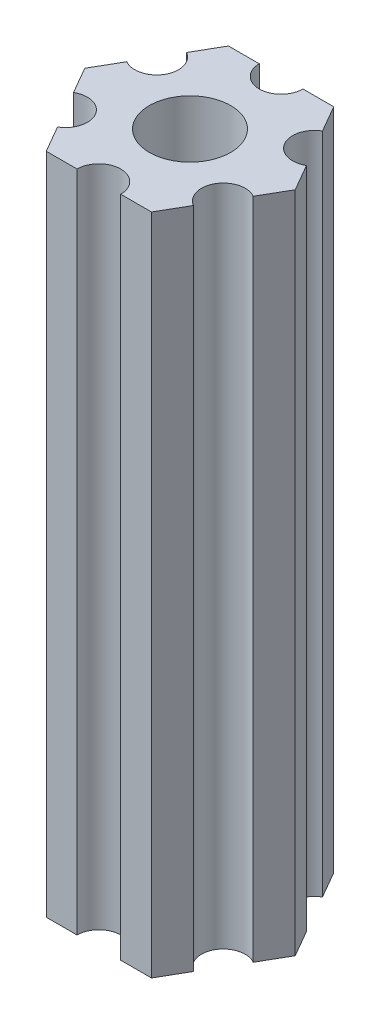
ISO-10303-21;
HEADER;
FILE_DESCRIPTION(('STEP AP214'),'2;1');
FILE_NAME('part.step','',(''),(''),'','','');
FILE_SCHEMA(('AUTOMOTIVE_DESIGN { 1 0 10303 214 1 1 1 1 }'));
ENDSEC;
DATA;
#1=APPLICATION_CONTEXT('core data for automotive mechanical design processes');
#2=APPLICATION_PROTOCOL_DEFINITION('international standard','automotive_design',2000,#1);
#3=PRODUCT_CONTEXT('',#1,'mechanical');
#4=PRODUCT('Part','Part','',(#3));
#5=PRODUCT_RELATED_PRODUCT_CATEGORY('part','',(#4));
#6=PRODUCT_DEFINITION_FORMATION('','',#4);
#7=PRODUCT_DEFINITION_CONTEXT('part definition',#1,'design');
#8=PRODUCT_DEFINITION('design','',#6,#7);
#9=PRODUCT_DEFINITION_SHAPE('','',#8);
#10=(LENGTH_UNIT() NAMED_UNIT(*) SI_UNIT(.MILLI.,.METRE.));
#11=(NAMED_UNIT(*) PLANE_ANGLE_UNIT() SI_UNIT($,.RADIAN.));
#12=(NAMED_UNIT(*) SI_UNIT($,.STERADIAN.) SOLID_ANGLE_UNIT());
#13=UNCERTAINTY_MEASURE_WITH_UNIT(LENGTH_MEASURE(1.E-05),#10,'distance_accuracy_value','');
#14=(GEOMETRIC_REPRESENTATION_CONTEXT(3) GLOBAL_UNCERTAINTY_ASSIGNED_CONTEXT((#13)) GLOBAL_UNIT_ASSIGNED_CONTEXT((#10,
#11,#12)) REPRESENTATION_CONTEXT('',''));
#15=CARTESIAN_POINT('',(0.,0.,0.));
#16=DIRECTION('',(0.,0.,1.));
#17=DIRECTION('',(1.,0.,0.));
#18=AXIS2_PLACEMENT_3D('',#15,#16,#17);
#19=CARTESIAN_POINT('',(76.3126587736527,11.,15.875));
#20=DIRECTION('',(0.,-1.,0.));
#21=DIRECTION('',(0.,0.,-1.));
#22=AXIS2_PLACEMENT_3D('',#19,#20,#21);
#23=CYLINDRICAL_SURFACE('',#22,1.50000000000002);
#24=CARTESIAN_POINT('',(76.3126587736527,-34.5,15.875));
#25=DIRECTION('',(0.,1.,0.));
#26=DIRECTION('',(0.,0.,1.));
#27=AXIS2_PLACEMENT_3D('',#24,#25,#26);
#28=CIRCLE('',#27,1.50000000000002);
#29=CARTESIAN_POINT('',(75.5626587736527,-34.5,14.5759618943233));
#30=VERTEX_POINT('',#29);
#31=CARTESIAN_POINT('',(77.0626587736528,-34.5,17.1740381056767));
#32=VERTEX_POINT('',#31);
#33=EDGE_CURVE('E189',#30,#32,#28,.T.);
#34=ORIENTED_EDGE('',*,*,#33,.F.);
#35=DIRECTION('',(0.,-1.,0.));
#36=VECTOR('',#35,1.);
#37=CARTESIAN_POINT('',(75.5626587736527,11.,14.5759618943233));
#38=LINE('',#37,#36);
#39=CARTESIAN_POINT('',(75.5626587736527,11.,14.5759618943233));
#40=VERTEX_POINT('',#39);
#41=EDGE_CURVE('E11',#40,#30,#38,.T.);
#42=ORIENTED_EDGE('',*,*,#41,.F.);
#43=CARTESIAN_POINT('',(76.3126587736527,11.,15.875));
#44=DIRECTION('',(0.,1.,0.));
#45=DIRECTION('',(0.,0.,1.));
#46=AXIS2_PLACEMENT_3D('',#43,#44,#45);
#47=CIRCLE('',#46,1.50000000000002);
#48=CARTESIAN_POINT('',(77.0626587736528,11.,17.1740381056767));
#49=VERTEX_POINT('',#48);
#50=EDGE_CURVE('E240',#40,#49,#47,.T.);
#51=ORIENTED_EDGE('',*,*,#50,.T.);
#52=DIRECTION('',(0.,-1.,0.));
#53=VECTOR('',#52,1.);
#54=CARTESIAN_POINT('',(77.0626587736528,11.,17.1740381056767));
#55=LINE('',#54,#53);
#56=EDGE_CURVE('E35',#49,#32,#55,.T.);
#57=ORIENTED_EDGE('',*,*,#56,.T.);
#58=EDGE_LOOP('',(#34,#42,#51,#57));
#59=FACE_BOUND('',#58,.T.);
#60=ADVANCED_FACE('F32',(#59),#23,.F.);
#61=CARTESIAN_POINT('',(74.5084391824352,11.,12.75));
#62=DIRECTION('',(0.866025403784455,0.,-0.499999999999972));
#63=DIRECTION('',(-0.499999999999972,0.,-0.866025403784455));
#64=AXIS2_PLACEMENT_3D('',#61,#62,#63);
#65=PLANE('',#64);
#66=DIRECTION('',(0.499999999999972,0.,0.866025403784455));
#67=VECTOR('',#66,1.);
#68=CARTESIAN_POINT('',(74.5084391824352,-34.5,12.75));
#69=LINE('',#68,#67);
#70=CARTESIAN_POINT('',(74.5084391824352,-34.5,12.75));
#71=VERTEX_POINT('',#70);
#72=EDGE_CURVE('E238',#71,#30,#69,.T.);
#73=ORIENTED_EDGE('',*,*,#72,.F.);
#74=DIRECTION('',(0.,-1.,0.));
#75=VECTOR('',#74,1.);
#76=CARTESIAN_POINT('',(74.5084391824352,11.,12.75));
#77=LINE('',#76,#75);
#78=CARTESIAN_POINT('',(74.5084391824352,11.,12.75));
#79=VERTEX_POINT('',#78);
#80=EDGE_CURVE('E41',#79,#71,#77,.T.);
#81=ORIENTED_EDGE('',*,*,#80,.F.);
#82=DIRECTION('',(0.499999999999972,0.,0.866025403784455));
#83=VECTOR('',#82,1.);
#84=CARTESIAN_POINT('',(74.5084391824352,11.,12.75));
#85=LINE('',#84,#83);
#86=EDGE_CURVE('E179',#79,#40,#85,.T.);
#87=ORIENTED_EDGE('',*,*,#86,.T.);
#88=ORIENTED_EDGE('',*,*,#41,.T.);
#89=EDGE_LOOP('',(#73,#81,#87,#88));
#90=FACE_BOUND('',#89,.T.);
#91=ADVANCED_FACE('F272',(#90),#65,.T.);
#92=CARTESIAN_POINT('',(72.4,11.,12.75));
#93=DIRECTION('',(0.,0.,-1.));
#94=DIRECTION('',(-1.,0.,0.));
#95=AXIS2_PLACEMENT_3D('',#92,#93,#94);
#96=PLANE('',#95);
#97=DIRECTION('',(1.,0.,0.));
#98=VECTOR('',#97,1.);
#99=CARTESIAN_POINT('',(72.4,-34.5,12.75));
#100=LINE('',#99,#98);
#101=CARTESIAN_POINT('',(72.4,-34.5,12.75));
#102=VERTEX_POINT('',#101);
#103=EDGE_CURVE('E166',#102,#71,#100,.T.);
#104=ORIENTED_EDGE('',*,*,#103,.F.);
#105=DIRECTION('',(0.,-1.,0.));
#106=VECTOR('',#105,1.);
#107=CARTESIAN_POINT('',(72.4,11.,12.75));
#108=LINE('',#107,#106);
#109=CARTESIAN_POINT('',(72.4,11.,12.75));
#110=VERTEX_POINT('',#109);
#111=EDGE_CURVE('E161',#110,#102,#108,.T.);
#112=ORIENTED_EDGE('',*,*,#111,.F.);
#113=DIRECTION('',(1.,0.,0.));
#114=VECTOR('',#113,1.);
#115=CARTESIAN_POINT('',(72.4,11.,12.75));
#116=LINE('',#115,#114);
#117=EDGE_CURVE('E164',#110,#79,#116,.T.);
#118=ORIENTED_EDGE('',*,*,#117,.T.);
#119=ORIENTED_EDGE('',*,*,#80,.T.);
#120=EDGE_LOOP('',(#104,#112,#118,#119));
#121=FACE_BOUND('',#120,.T.);
#122=ADVANCED_FACE('F163',(#121),#96,.T.);
#123=CARTESIAN_POINT('',(70.9,11.,12.75));
#124=DIRECTION('',(0.,-1.,0.));
#125=DIRECTION('',(0.,0.,-1.));
#126=AXIS2_PLACEMENT_3D('',#123,#124,#125);
#127=CYLINDRICAL_SURFACE('',#126,1.5);
#128=CARTESIAN_POINT('',(70.9,-34.5,12.75));
#129=DIRECTION('',(0.,1.,0.));
#130=DIRECTION('',(0.,0.,1.));
#131=AXIS2_PLACEMENT_3D('',#128,#129,#130);
#132=CIRCLE('',#131,1.5);
#133=CARTESIAN_POINT('',(69.4,-34.5,12.75));
#134=VERTEX_POINT('',#133);
#135=EDGE_CURVE('E235',#134,#102,#132,.T.);
#136=ORIENTED_EDGE('',*,*,#135,.F.);
#137=DIRECTION('',(0.,-1.,0.));
#138=VECTOR('',#137,1.);
#139=CARTESIAN_POINT('',(69.4,11.,12.75));
#140=LINE('',#139,#138);
#141=CARTESIAN_POINT('',(69.4,11.,12.75));
#142=VERTEX_POINT('',#141);
#143=EDGE_CURVE('E171',#142,#134,#140,.T.);
#144=ORIENTED_EDGE('',*,*,#143,.F.);
#145=CARTESIAN_POINT('',(70.9,11.,12.75));
#146=DIRECTION('',(0.,1.,0.));
#147=DIRECTION('',(0.,0.,1.));
#148=AXIS2_PLACEMENT_3D('',#145,#146,#147);
#149=CIRCLE('',#148,1.5);
#150=EDGE_CURVE('E177',#142,#110,#149,.T.);
#151=ORIENTED_EDGE('',*,*,#150,.T.);
#152=ORIENTED_EDGE('',*,*,#111,.T.);
#153=EDGE_LOOP('',(#136,#144,#151,#152));
#154=FACE_BOUND('',#153,.T.);
#155=ADVANCED_FACE('F181',(#154),#127,.F.);
#156=CARTESIAN_POINT('',(67.2915608175649,11.,12.75));
#157=DIRECTION('',(0.,0.,-1.));
#158=DIRECTION('',(-1.,0.,0.));
#159=AXIS2_PLACEMENT_3D('',#156,#157,#158);
#160=PLANE('',#159);
#161=DIRECTION('',(1.,0.,0.));
#162=VECTOR('',#161,1.);
#163=CARTESIAN_POINT('',(67.2915608175649,-34.5,12.75));
#164=LINE('',#163,#162);
#165=CARTESIAN_POINT('',(67.2915608175649,-34.5,12.75));
#166=VERTEX_POINT('',#165);
#167=EDGE_CURVE('E232',#166,#134,#164,.T.);
#168=ORIENTED_EDGE('',*,*,#167,.F.);
#169=DIRECTION('',(0.,-1.,0.));
#170=VECTOR('',#169,1.);
#171=CARTESIAN_POINT('',(67.2915608175649,11.,12.75));
#172=LINE('',#171,#170);
#173=CARTESIAN_POINT('',(67.2915608175649,11.,12.75));
#174=VERTEX_POINT('',#173);
#175=EDGE_CURVE('E244',#174,#166,#172,.T.);
#176=ORIENTED_EDGE('',*,*,#175,.F.);
#177=DIRECTION('',(1.,0.,0.));
#178=VECTOR('',#177,1.);
#179=CARTESIAN_POINT('',(67.2915608175649,11.,12.75));
#180=LINE('',#179,#178);
#181=EDGE_CURVE('E182',#174,#142,#180,.T.);
#182=ORIENTED_EDGE('',*,*,#181,.T.);
#183=ORIENTED_EDGE('',*,*,#143,.T.);
#184=EDGE_LOOP('',(#168,#176,#182,#183));
#185=FACE_BOUND('',#184,.T.);
#186=ADVANCED_FACE('F285',(#185),#160,.T.);
#187=CARTESIAN_POINT('',(66.2373412263473,11.,14.5759618943233));
#188=DIRECTION('',(-0.866025403784432,0.,-0.500000000000011));
#189=DIRECTION('',(-0.500000000000011,0.,0.866025403784432));
#190=AXIS2_PLACEMENT_3D('',#187,#188,#189);
#191=PLANE('',#190);
#192=DIRECTION('',(0.500000000000011,0.,-0.866025403784432));
#193=VECTOR('',#192,1.);
#194=CARTESIAN_POINT('',(66.2373412263473,-34.5,14.5759618943233));
#195=LINE('',#194,#193);
#196=CARTESIAN_POINT('',(66.2373412263473,-34.5,14.5759618943233));
#197=VERTEX_POINT('',#196);
#198=EDGE_CURVE('E229',#197,#166,#195,.T.);
#199=ORIENTED_EDGE('',*,*,#198,.F.);
#200=DIRECTION('',(0.,-1.,0.));
#201=VECTOR('',#200,1.);
#202=CARTESIAN_POINT('',(66.2373412263473,11.,14.5759618943233));
#203=LINE('',#202,#201);
#204=CARTESIAN_POINT('',(66.2373412263473,11.,14.5759618943233));
#205=VERTEX_POINT('',#204);
#206=EDGE_CURVE('E246',#205,#197,#203,.T.);
#207=ORIENTED_EDGE('',*,*,#206,.F.);
#208=DIRECTION('',(0.500000000000011,0.,-0.866025403784432));
#209=VECTOR('',#208,1.);
#210=CARTESIAN_POINT('',(66.2373412263473,11.,14.5759618943233));
#211=LINE('',#210,#209);
#212=EDGE_CURVE('E184',#205,#174,#211,.T.);
#213=ORIENTED_EDGE('',*,*,#212,.T.);
#214=ORIENTED_EDGE('',*,*,#175,.T.);
#215=EDGE_LOOP('',(#199,#207,#213,#214));
#216=FACE_BOUND('',#215,.T.);
#217=ADVANCED_FACE('F288',(#216),#191,.T.);
#218=CARTESIAN_POINT('',(65.4873412263473,11.,15.875));
#219=DIRECTION('',(0.,-1.,0.));
#220=DIRECTION('',(0.,0.,-1.));
#221=AXIS2_PLACEMENT_3D('',#218,#219,#220);
#222=CYLINDRICAL_SURFACE('',#221,1.49999999999999);
#223=CARTESIAN_POINT('',(65.4873412263473,-34.5,15.875));
#224=DIRECTION('',(0.,1.,0.));
#225=DIRECTION('',(0.,0.,1.));
#226=AXIS2_PLACEMENT_3D('',#223,#224,#225);
#227=CIRCLE('',#226,1.49999999999999);
#228=CARTESIAN_POINT('',(64.7373412263473,-34.5,17.1740381056767));
#229=VERTEX_POINT('',#228);
#230=EDGE_CURVE('E226',#229,#197,#227,.T.);
#231=ORIENTED_EDGE('',*,*,#230,.F.);
#232=DIRECTION('',(0.,-1.,0.));
#233=VECTOR('',#232,1.);
#234=CARTESIAN_POINT('',(64.7373412263473,11.,17.1740381056767));
#235=LINE('',#234,#233);
#236=CARTESIAN_POINT('',(64.7373412263473,11.,17.1740381056767));
#237=VERTEX_POINT('',#236);
#238=EDGE_CURVE('E248',#237,#229,#235,.T.);
#239=ORIENTED_EDGE('',*,*,#238,.F.);
#240=CARTESIAN_POINT('',(65.4873412263473,11.,15.875));
#241=DIRECTION('',(0.,1.,0.));
#242=DIRECTION('',(0.,0.,1.));
#243=AXIS2_PLACEMENT_3D('',#240,#241,#242);
#244=CIRCLE('',#243,1.49999999999999);
#245=EDGE_CURVE('E393',#237,#205,#244,.T.);
#246=ORIENTED_EDGE('',*,*,#245,.T.);
#247=ORIENTED_EDGE('',*,*,#206,.T.);
#248=EDGE_LOOP('',(#231,#239,#246,#247));
#249=FACE_BOUND('',#248,.T.);
#250=ADVANCED_FACE('F292',(#249),#222,.F.);
#251=CARTESIAN_POINT('',(63.6831216351297,11.,19.));
#252=DIRECTION('',(-0.866025403784433,0.,-0.50000000000001));
#253=DIRECTION('',(-0.50000000000001,0.,0.866025403784433));
#254=AXIS2_PLACEMENT_3D('',#251,#252,#253);
#255=PLANE('',#254);
#256=DIRECTION('',(0.50000000000001,0.,-0.866025403784433));
#257=VECTOR('',#256,1.);
#258=CARTESIAN_POINT('',(63.6831216351297,-34.5,19.));
#259=LINE('',#258,#257);
#260=CARTESIAN_POINT('',(63.6831216351297,-34.5,19.));
#261=VERTEX_POINT('',#260);
#262=EDGE_CURVE('E223',#261,#229,#259,.T.);
#263=ORIENTED_EDGE('',*,*,#262,.F.);
#264=DIRECTION('',(0.,-1.,0.));
#265=VECTOR('',#264,1.);
#266=CARTESIAN_POINT('',(63.6831216351297,11.,19.));
#267=LINE('',#266,#265);
#268=CARTESIAN_POINT('',(63.6831216351297,11.,19.));
#269=VERTEX_POINT('',#268);
#270=EDGE_CURVE('E250',#269,#261,#267,.T.);
#271=ORIENTED_EDGE('',*,*,#270,.F.);
#272=DIRECTION('',(0.50000000000001,0.,-0.866025403784433));
#273=VECTOR('',#272,1.);
#274=CARTESIAN_POINT('',(63.6831216351297,11.,19.));
#275=LINE('',#274,#273);
#276=EDGE_CURVE('E390',#269,#237,#275,.T.);
#277=ORIENTED_EDGE('',*,*,#276,.T.);
#278=ORIENTED_EDGE('',*,*,#238,.T.);
#279=EDGE_LOOP('',(#263,#271,#277,#278));
#280=FACE_BOUND('',#279,.T.);
#281=ADVANCED_FACE('F296',(#280),#255,.T.);
#282=CARTESIAN_POINT('',(64.7373412263473,11.,20.8259618943233));
#283=DIRECTION('',(-0.866025403784433,0.,0.50000000000001));
#284=DIRECTION('',(0.50000000000001,0.,0.866025403784433));
#285=AXIS2_PLACEMENT_3D('',#282,#283,#284);
#286=PLANE('',#285);
#287=DIRECTION('',(-0.50000000000001,0.,-0.866025403784433));
#288=VECTOR('',#287,1.);
#289=CARTESIAN_POINT('',(64.7373412263473,-34.5,20.8259618943233));
#290=LINE('',#289,#288);
#291=CARTESIAN_POINT('',(64.7373412263473,-34.5,20.8259618943234));
#292=VERTEX_POINT('',#291);
#293=EDGE_CURVE('E220',#292,#261,#290,.T.);
#294=ORIENTED_EDGE('',*,*,#293,.F.);
#295=DIRECTION('',(0.,-1.,0.));
#296=VECTOR('',#295,1.);
#297=CARTESIAN_POINT('',(64.7373412263473,11.,20.8259618943234));
#298=LINE('',#297,#296);
#299=CARTESIAN_POINT('',(64.7373412263473,11.,20.8259618943234));
#300=VERTEX_POINT('',#299);
#301=EDGE_CURVE('E252',#300,#292,#298,.T.);
#302=ORIENTED_EDGE('',*,*,#301,.F.);
#303=DIRECTION('',(-0.50000000000001,0.,-0.866025403784433));
#304=VECTOR('',#303,1.);
#305=CARTESIAN_POINT('',(64.7373412263473,11.,20.8259618943233));
#306=LINE('',#305,#304);
#307=EDGE_CURVE('E387',#300,#269,#306,.T.);
#308=ORIENTED_EDGE('',*,*,#307,.T.);
#309=ORIENTED_EDGE('',*,*,#270,.T.);
#310=EDGE_LOOP('',(#294,#302,#308,#309));
#311=FACE_BOUND('',#310,.T.);
#312=ADVANCED_FACE('F300',(#311),#286,.T.);
#313=CARTESIAN_POINT('',(65.4873412263473,11.,22.125));
#314=DIRECTION('',(0.,-1.,0.));
#315=DIRECTION('',(0.,0.,-1.));
#316=AXIS2_PLACEMENT_3D('',#313,#314,#315);
#317=CYLINDRICAL_SURFACE('',#316,1.49999999999999);
#318=CARTESIAN_POINT('',(65.4873412263473,-34.5,22.125));
#319=DIRECTION('',(0.,1.,0.));
#320=DIRECTION('',(0.,0.,1.));
#321=AXIS2_PLACEMENT_3D('',#318,#319,#320);
#322=CIRCLE('',#321,1.49999999999999);
#323=CARTESIAN_POINT('',(66.2373412263473,-34.5,23.4240381056767));
#324=VERTEX_POINT('',#323);
#325=EDGE_CURVE('E217',#324,#292,#322,.T.);
#326=ORIENTED_EDGE('',*,*,#325,.F.);
#327=DIRECTION('',(0.,-1.,0.));
#328=VECTOR('',#327,1.);
#329=CARTESIAN_POINT('',(66.2373412263473,11.,23.4240381056767));
#330=LINE('',#329,#328);
#331=CARTESIAN_POINT('',(66.2373412263473,11.,23.4240381056767));
#332=VERTEX_POINT('',#331);
#333=EDGE_CURVE('E254',#332,#324,#330,.T.);
#334=ORIENTED_EDGE('',*,*,#333,.F.);
#335=CARTESIAN_POINT('',(65.4873412263473,11.,22.125));
#336=DIRECTION('',(0.,1.,0.));
#337=DIRECTION('',(0.,0.,1.));
#338=AXIS2_PLACEMENT_3D('',#335,#336,#337);
#339=CIRCLE('',#338,1.49999999999999);
#340=EDGE_CURVE('E384',#332,#300,#339,.T.);
#341=ORIENTED_EDGE('',*,*,#340,.T.);
#342=ORIENTED_EDGE('',*,*,#301,.T.);
#343=EDGE_LOOP('',(#326,#334,#341,#342));
#344=FACE_BOUND('',#343,.T.);
#345=ADVANCED_FACE('F304',(#344),#317,.F.);
#346=CARTESIAN_POINT('',(67.2915608175649,11.,25.25));
#347=DIRECTION('',(-0.866025403784433,0.,0.500000000000009));
#348=DIRECTION('',(0.500000000000009,0.,0.866025403784433));
#349=AXIS2_PLACEMENT_3D('',#346,#347,#348);
#350=PLANE('',#349);
#351=DIRECTION('',(-0.500000000000009,0.,-0.866025403784433));
#352=VECTOR('',#351,1.);
#353=CARTESIAN_POINT('',(67.2915608175649,-34.5,25.25));
#354=LINE('',#353,#352);
#355=CARTESIAN_POINT('',(67.2915608175649,-34.5,25.25));
#356=VERTEX_POINT('',#355);
#357=EDGE_CURVE('E214',#356,#324,#354,.T.);
#358=ORIENTED_EDGE('',*,*,#357,.F.);
#359=DIRECTION('',(0.,-1.,0.));
#360=VECTOR('',#359,1.);
#361=CARTESIAN_POINT('',(67.2915608175649,11.,25.25));
#362=LINE('',#361,#360);
#363=CARTESIAN_POINT('',(67.2915608175649,11.,25.25));
#364=VERTEX_POINT('',#363);
#365=EDGE_CURVE('E256',#364,#356,#362,.T.);
#366=ORIENTED_EDGE('',*,*,#365,.F.);
#367=DIRECTION('',(-0.500000000000009,0.,-0.866025403784433));
#368=VECTOR('',#367,1.);
#369=CARTESIAN_POINT('',(67.2915608175649,11.,25.25));
#370=LINE('',#369,#368);
#371=EDGE_CURVE('E381',#364,#332,#370,.T.);
#372=ORIENTED_EDGE('',*,*,#371,.T.);
#373=ORIENTED_EDGE('',*,*,#333,.T.);
#374=EDGE_LOOP('',(#358,#366,#372,#373));
#375=FACE_BOUND('',#374,.T.);
#376=ADVANCED_FACE('F308',(#375),#350,.T.);
#377=CARTESIAN_POINT('',(69.4,11.,25.25));
#378=DIRECTION('',(0.,0.,1.));
#379=DIRECTION('',(1.,0.,0.));
#380=AXIS2_PLACEMENT_3D('',#377,#378,#379);
#381=PLANE('',#380);
#382=DIRECTION('',(-1.,0.,0.));
#383=VECTOR('',#382,1.);
#384=CARTESIAN_POINT('',(69.4,-34.5,25.25));
#385=LINE('',#384,#383);
#386=CARTESIAN_POINT('',(69.4,-34.5,25.25));
#387=VERTEX_POINT('',#386);
#388=EDGE_CURVE('E211',#387,#356,#385,.T.);
#389=ORIENTED_EDGE('',*,*,#388,.F.);
#390=DIRECTION('',(0.,-1.,0.));
#391=VECTOR('',#390,1.);
#392=CARTESIAN_POINT('',(69.4,11.,25.25));
#393=LINE('',#392,#391);
#394=CARTESIAN_POINT('',(69.4,11.,25.25));
#395=VERTEX_POINT('',#394);
#396=EDGE_CURVE('E258',#395,#387,#393,.T.);
#397=ORIENTED_EDGE('',*,*,#396,.F.);
#398=DIRECTION('',(-1.,0.,0.));
#399=VECTOR('',#398,1.);
#400=CARTESIAN_POINT('',(69.4,11.,25.25));
#401=LINE('',#400,#399);
#402=EDGE_CURVE('E378',#395,#364,#401,.T.);
#403=ORIENTED_EDGE('',*,*,#402,.T.);
#404=ORIENTED_EDGE('',*,*,#365,.T.);
#405=EDGE_LOOP('',(#389,#397,#403,#404));
#406=FACE_BOUND('',#405,.T.);
#407=ADVANCED_FACE('F312',(#406),#381,.T.);
#408=CARTESIAN_POINT('',(70.9,11.,25.25));
#409=DIRECTION('',(0.,-1.,0.));
#410=DIRECTION('',(0.,0.,-1.));
#411=AXIS2_PLACEMENT_3D('',#408,#409,#410);
#412=CYLINDRICAL_SURFACE('',#411,1.5);
#413=CARTESIAN_POINT('',(70.9,-34.5,25.25));
#414=DIRECTION('',(0.,1.,0.));
#415=DIRECTION('',(0.,0.,1.));
#416=AXIS2_PLACEMENT_3D('',#413,#414,#415);
#417=CIRCLE('',#416,1.5);
#418=CARTESIAN_POINT('',(72.4,-34.5,25.25));
#419=VERTEX_POINT('',#418);
#420=EDGE_CURVE('E208',#419,#387,#417,.T.);
#421=ORIENTED_EDGE('',*,*,#420,.F.);
#422=DIRECTION('',(0.,-1.,0.));
#423=VECTOR('',#422,1.);
#424=CARTESIAN_POINT('',(72.4,11.,25.25));
#425=LINE('',#424,#423);
#426=CARTESIAN_POINT('',(72.4,11.,25.25));
#427=VERTEX_POINT('',#426);
#428=EDGE_CURVE('E260',#427,#419,#425,.T.);
#429=ORIENTED_EDGE('',*,*,#428,.F.);
#430=CARTESIAN_POINT('',(70.9,11.,25.25));
#431=DIRECTION('',(0.,1.,0.));
#432=DIRECTION('',(0.,0.,1.));
#433=AXIS2_PLACEMENT_3D('',#430,#431,#432);
#434=CIRCLE('',#433,1.5);
#435=EDGE_CURVE('E375',#427,#395,#434,.T.);
#436=ORIENTED_EDGE('',*,*,#435,.T.);
#437=ORIENTED_EDGE('',*,*,#396,.T.);
#438=EDGE_LOOP('',(#421,#429,#436,#437));
#439=FACE_BOUND('',#438,.T.);
#440=ADVANCED_FACE('F316',(#439),#412,.F.);
#441=CARTESIAN_POINT('',(74.5084391824352,11.,25.25));
#442=DIRECTION('',(0.,0.,1.));
#443=DIRECTION('',(1.,0.,0.));
#444=AXIS2_PLACEMENT_3D('',#441,#442,#443);
#445=PLANE('',#444);
#446=DIRECTION('',(-1.,0.,0.));
#447=VECTOR('',#446,1.);
#448=CARTESIAN_POINT('',(74.5084391824352,-34.5,25.25));
#449=LINE('',#448,#447);
#450=CARTESIAN_POINT('',(74.5084391824352,-34.5,25.25));
#451=VERTEX_POINT('',#450);
#452=EDGE_CURVE('E205',#451,#419,#449,.T.);
#453=ORIENTED_EDGE('',*,*,#452,.F.);
#454=DIRECTION('',(0.,-1.,0.));
#455=VECTOR('',#454,1.);
#456=CARTESIAN_POINT('',(74.5084391824352,11.,25.25));
#457=LINE('',#456,#455);
#458=CARTESIAN_POINT('',(74.5084391824352,11.,25.25));
#459=VERTEX_POINT('',#458);
#460=EDGE_CURVE('E262',#459,#451,#457,.T.);
#461=ORIENTED_EDGE('',*,*,#460,.F.);
#462=DIRECTION('',(-1.,0.,0.));
#463=VECTOR('',#462,1.);
#464=CARTESIAN_POINT('',(74.5084391824352,11.,25.25));
#465=LINE('',#464,#463);
#466=EDGE_CURVE('E372',#459,#427,#465,.T.);
#467=ORIENTED_EDGE('',*,*,#466,.T.);
#468=ORIENTED_EDGE('',*,*,#428,.T.);
#469=EDGE_LOOP('',(#453,#461,#467,#468));
#470=FACE_BOUND('',#469,.T.);
#471=ADVANCED_FACE('F320',(#470),#445,.T.);
#472=CARTESIAN_POINT('',(75.5626587736528,11.,23.4240381056767));
#473=DIRECTION('',(0.866025403784438,0.,0.500000000000002));
#474=DIRECTION('',(0.500000000000002,0.,-0.866025403784437));
#475=AXIS2_PLACEMENT_3D('',#472,#473,#474);
#476=PLANE('',#475);
#477=DIRECTION('',(-0.500000000000002,0.,0.866025403784437));
#478=VECTOR('',#477,1.);
#479=CARTESIAN_POINT('',(75.5626587736528,-34.5,23.4240381056767));
#480=LINE('',#479,#478);
#481=CARTESIAN_POINT('',(75.5626587736528,-34.5,23.4240381056767));
#482=VERTEX_POINT('',#481);
#483=EDGE_CURVE('E202',#482,#451,#480,.T.);
#484=ORIENTED_EDGE('',*,*,#483,.F.);
#485=DIRECTION('',(0.,-1.,0.));
#486=VECTOR('',#485,1.);
#487=CARTESIAN_POINT('',(75.5626587736528,11.,23.4240381056767));
#488=LINE('',#487,#486);
#489=CARTESIAN_POINT('',(75.5626587736528,11.,23.4240381056767));
#490=VERTEX_POINT('',#489);
#491=EDGE_CURVE('E264',#490,#482,#488,.T.);
#492=ORIENTED_EDGE('',*,*,#491,.F.);
#493=DIRECTION('',(-0.500000000000002,0.,0.866025403784437));
#494=VECTOR('',#493,1.);
#495=CARTESIAN_POINT('',(75.5626587736528,11.,23.4240381056767));
#496=LINE('',#495,#494);
#497=EDGE_CURVE('E369',#490,#459,#496,.T.);
#498=ORIENTED_EDGE('',*,*,#497,.T.);
#499=ORIENTED_EDGE('',*,*,#460,.T.);
#500=EDGE_LOOP('',(#484,#492,#498,#499));
#501=FACE_BOUND('',#500,.T.);
#502=ADVANCED_FACE('F324',(#501),#476,.T.);
#503=CARTESIAN_POINT('',(76.3126587736528,11.,22.125));
#504=DIRECTION('',(0.,-1.,0.));
#505=DIRECTION('',(0.,0.,-1.));
#506=AXIS2_PLACEMENT_3D('',#503,#504,#505);
#507=CYLINDRICAL_SURFACE('',#506,1.50000000000002);
#508=CARTESIAN_POINT('',(76.3126587736528,-34.5,22.125));
#509=DIRECTION('',(0.,1.,0.));
#510=DIRECTION('',(0.,0.,1.));
#511=AXIS2_PLACEMENT_3D('',#508,#509,#510);
#512=CIRCLE('',#511,1.50000000000002);
#513=CARTESIAN_POINT('',(77.0626587736528,-34.5,20.8259618943234));
#514=VERTEX_POINT('',#513);
#515=EDGE_CURVE('E199',#514,#482,#512,.T.);
#516=ORIENTED_EDGE('',*,*,#515,.F.);
#517=DIRECTION('',(0.,-1.,0.));
#518=VECTOR('',#517,1.);
#519=CARTESIAN_POINT('',(77.0626587736528,11.,20.8259618943234));
#520=LINE('',#519,#518);
#521=CARTESIAN_POINT('',(77.0626587736528,11.,20.8259618943234));
#522=VERTEX_POINT('',#521);
#523=EDGE_CURVE('E266',#522,#514,#520,.T.);
#524=ORIENTED_EDGE('',*,*,#523,.F.);
#525=CARTESIAN_POINT('',(76.3126587736528,11.,22.125));
#526=DIRECTION('',(0.,1.,0.));
#527=DIRECTION('',(0.,0.,1.));
#528=AXIS2_PLACEMENT_3D('',#525,#526,#527);
#529=CIRCLE('',#528,1.50000000000002);
#530=EDGE_CURVE('E366',#522,#490,#529,.T.);
#531=ORIENTED_EDGE('',*,*,#530,.T.);
#532=ORIENTED_EDGE('',*,*,#491,.T.);
#533=EDGE_LOOP('',(#516,#524,#531,#532));
#534=FACE_BOUND('',#533,.T.);
#535=ADVANCED_FACE('F328',(#534),#507,.F.);
#536=CARTESIAN_POINT('',(78.1168783648703,11.,19.));
#537=DIRECTION('',(0.866025403784448,0.,0.499999999999984));
#538=DIRECTION('',(0.499999999999984,0.,-0.866025403784448));
#539=AXIS2_PLACEMENT_3D('',#536,#537,#538);
#540=PLANE('',#539);
#541=DIRECTION('',(-0.499999999999984,0.,0.866025403784448));
#542=VECTOR('',#541,1.);
#543=CARTESIAN_POINT('',(78.1168783648703,-34.5,19.));
#544=LINE('',#543,#542);
#545=CARTESIAN_POINT('',(78.1168783648703,-34.5,19.));
#546=VERTEX_POINT('',#545);
#547=EDGE_CURVE('E196',#546,#514,#544,.T.);
#548=ORIENTED_EDGE('',*,*,#547,.F.);
#549=DIRECTION('',(0.,-1.,0.));
#550=VECTOR('',#549,1.);
#551=CARTESIAN_POINT('',(78.1168783648703,11.,19.));
#552=LINE('',#551,#550);
#553=CARTESIAN_POINT('',(78.1168783648703,11.,19.));
#554=VERTEX_POINT('',#553);
#555=EDGE_CURVE('E267',#554,#546,#552,.T.);
#556=ORIENTED_EDGE('',*,*,#555,.F.);
#557=DIRECTION('',(-0.499999999999984,0.,0.866025403784448));
#558=VECTOR('',#557,1.);
#559=CARTESIAN_POINT('',(78.1168783648703,11.,19.));
#560=LINE('',#559,#558);
#561=EDGE_CURVE('E363',#554,#522,#560,.T.);
#562=ORIENTED_EDGE('',*,*,#561,.T.);
#563=ORIENTED_EDGE('',*,*,#523,.T.);
#564=EDGE_LOOP('',(#548,#556,#562,#563));
#565=FACE_BOUND('',#564,.T.);
#566=ADVANCED_FACE('F332',(#565),#540,.T.);
#567=CARTESIAN_POINT('',(77.0626587736528,11.,17.1740381056767));
#568=DIRECTION('',(0.866025403784456,0.,-0.49999999999997));
#569=DIRECTION('',(-0.49999999999997,0.,-0.866025403784456));
#570=AXIS2_PLACEMENT_3D('',#567,#568,#569);
#571=PLANE('',#570);
#572=DIRECTION('',(0.49999999999997,0.,0.866025403784456));
#573=VECTOR('',#572,1.);
#574=CARTESIAN_POINT('',(77.0626587736528,-34.5,17.1740381056767));
#575=LINE('',#574,#573);
#576=EDGE_CURVE('E192',#32,#546,#575,.T.);
#577=ORIENTED_EDGE('',*,*,#576,.F.);
#578=ORIENTED_EDGE('',*,*,#56,.F.);
#579=DIRECTION('',(0.49999999999997,0.,0.866025403784456));
#580=VECTOR('',#579,1.);
#581=CARTESIAN_POINT('',(77.0626587736528,11.,17.1740381056767));
#582=LINE('',#581,#580);
#583=EDGE_CURVE('E361',#49,#554,#582,.T.);
#584=ORIENTED_EDGE('',*,*,#583,.T.);
#585=ORIENTED_EDGE('',*,*,#555,.T.);
#586=EDGE_LOOP('',(#577,#578,#584,#585));
#587=FACE_BOUND('',#586,.T.);
#588=ADVANCED_FACE('F269',(#587),#571,.T.);
#589=CARTESIAN_POINT('',(76.3126587736527,11.,15.875));
#590=DIRECTION('',(0.,1.,0.));
#591=DIRECTION('',(0.,0.,1.));
#592=AXIS2_PLACEMENT_3D('',#589,#590,#591);
#593=PLANE('',#592);
#594=CARTESIAN_POINT('',(70.9,11.,19.));
#595=DIRECTION('',(0.,-1.,0.));
#596=DIRECTION('',(0.,0.,1.));
#597=AXIS2_PLACEMENT_3D('',#594,#595,#596);
#598=CIRCLE('',#597,2.79);
#599=CARTESIAN_POINT('',(70.9,11.,21.79));
#600=VERTEX_POINT('',#599);
#601=EDGE_CURVE('E193',#600,#600,#598,.T.);
#602=ORIENTED_EDGE('',*,*,#601,.T.);
#603=EDGE_LOOP('',(#602));
#604=FACE_BOUND('',#603,.T.);
#605=ORIENTED_EDGE('',*,*,#50,.F.);
#606=ORIENTED_EDGE('',*,*,#86,.F.);
#607=ORIENTED_EDGE('',*,*,#117,.F.);
#608=ORIENTED_EDGE('',*,*,#150,.F.);
#609=ORIENTED_EDGE('',*,*,#181,.F.);
#610=ORIENTED_EDGE('',*,*,#212,.F.);
#611=ORIENTED_EDGE('',*,*,#245,.F.);
#612=ORIENTED_EDGE('',*,*,#276,.F.);
#613=ORIENTED_EDGE('',*,*,#307,.F.);
#614=ORIENTED_EDGE('',*,*,#340,.F.);
#615=ORIENTED_EDGE('',*,*,#371,.F.);
#616=ORIENTED_EDGE('',*,*,#402,.F.);
#617=ORIENTED_EDGE('',*,*,#435,.F.);
#618=ORIENTED_EDGE('',*,*,#466,.F.);
#619=ORIENTED_EDGE('',*,*,#497,.F.);
#620=ORIENTED_EDGE('',*,*,#530,.F.);
#621=ORIENTED_EDGE('',*,*,#561,.F.);
#622=ORIENTED_EDGE('',*,*,#583,.F.);
#623=EDGE_LOOP('',(#605,#606,#607,#608,#609,#610,#611,#612,#613,#614,#615,#616,#617,#618,#619,
#620,#621,#622));
#624=FACE_BOUND('',#623,.T.);
#625=ADVANCED_FACE('F175',(#604,#624),#593,.T.);
#626=CARTESIAN_POINT('',(76.3126587736527,-34.5,15.875));
#627=DIRECTION('',(0.,1.,0.));
#628=DIRECTION('',(0.,0.,1.));
#629=AXIS2_PLACEMENT_3D('',#626,#627,#628);
#630=PLANE('',#629);
#631=CARTESIAN_POINT('',(70.9,-34.5,19.));
#632=DIRECTION('',(0.,-1.,0.));
#633=DIRECTION('',(0.,0.,1.));
#634=AXIS2_PLACEMENT_3D('',#631,#632,#633);
#635=CIRCLE('',#634,2.79);
#636=CARTESIAN_POINT('',(70.9,-34.5,21.79));
#637=VERTEX_POINT('',#636);
#638=EDGE_CURVE('E356',#637,#637,#635,.T.);
#639=ORIENTED_EDGE('',*,*,#638,.F.);
#640=EDGE_LOOP('',(#639));
#641=FACE_BOUND('',#640,.T.);
#642=ORIENTED_EDGE('',*,*,#33,.T.);
#643=ORIENTED_EDGE('',*,*,#576,.T.);
#644=ORIENTED_EDGE('',*,*,#547,.T.);
#645=ORIENTED_EDGE('',*,*,#515,.T.);
#646=ORIENTED_EDGE('',*,*,#483,.T.);
#647=ORIENTED_EDGE('',*,*,#452,.T.);
#648=ORIENTED_EDGE('',*,*,#420,.T.);
#649=ORIENTED_EDGE('',*,*,#388,.T.);
#650=ORIENTED_EDGE('',*,*,#357,.T.);
#651=ORIENTED_EDGE('',*,*,#325,.T.);
#652=ORIENTED_EDGE('',*,*,#293,.T.);
#653=ORIENTED_EDGE('',*,*,#262,.T.);
#654=ORIENTED_EDGE('',*,*,#230,.T.);
#655=ORIENTED_EDGE('',*,*,#198,.T.);
#656=ORIENTED_EDGE('',*,*,#167,.T.);
#657=ORIENTED_EDGE('',*,*,#135,.T.);
#658=ORIENTED_EDGE('',*,*,#103,.T.);
#659=ORIENTED_EDGE('',*,*,#72,.T.);
#660=EDGE_LOOP('',(#642,#643,#644,#645,#646,#647,#648,#649,#650,#651,#652,#653,#654,#655,#656,
#657,#658,#659));
#661=FACE_BOUND('',#660,.T.);
#662=ADVANCED_FACE('F271',(#641,#661),#630,.F.);
#663=CARTESIAN_POINT('',(70.9,11.,19.));
#664=DIRECTION('',(0.,-1.,0.));
#665=DIRECTION('',(0.,0.,-1.));
#666=AXIS2_PLACEMENT_3D('',#663,#664,#665);
#667=CYLINDRICAL_SURFACE('',#666,2.79);
#668=ORIENTED_EDGE('',*,*,#601,.F.);
#669=EDGE_LOOP('',(#668));
#670=FACE_BOUND('',#669,.T.);
#671=ORIENTED_EDGE('',*,*,#638,.T.);
#672=EDGE_LOOP('',(#671));
#673=FACE_BOUND('',#672,.T.);
#674=ADVANCED_FACE('F344',(#670,#673),#667,.F.);
#675=CLOSED_SHELL('',(#60,#91,#122,#155,#186,#217,#250,#281,#312,#345,#376,#407,#440,#471,#502,
#535,#566,#588,#625,#662,#674));
#676=MANIFOLD_SOLID_BREP('B2',#675);
#677=ADVANCED_BREP_SHAPE_REPRESENTATION('',(#18,#676),#14);
#678=SHAPE_DEFINITION_REPRESENTATION(#9,#677);
ENDSEC;
END-ISO-10303-21;
